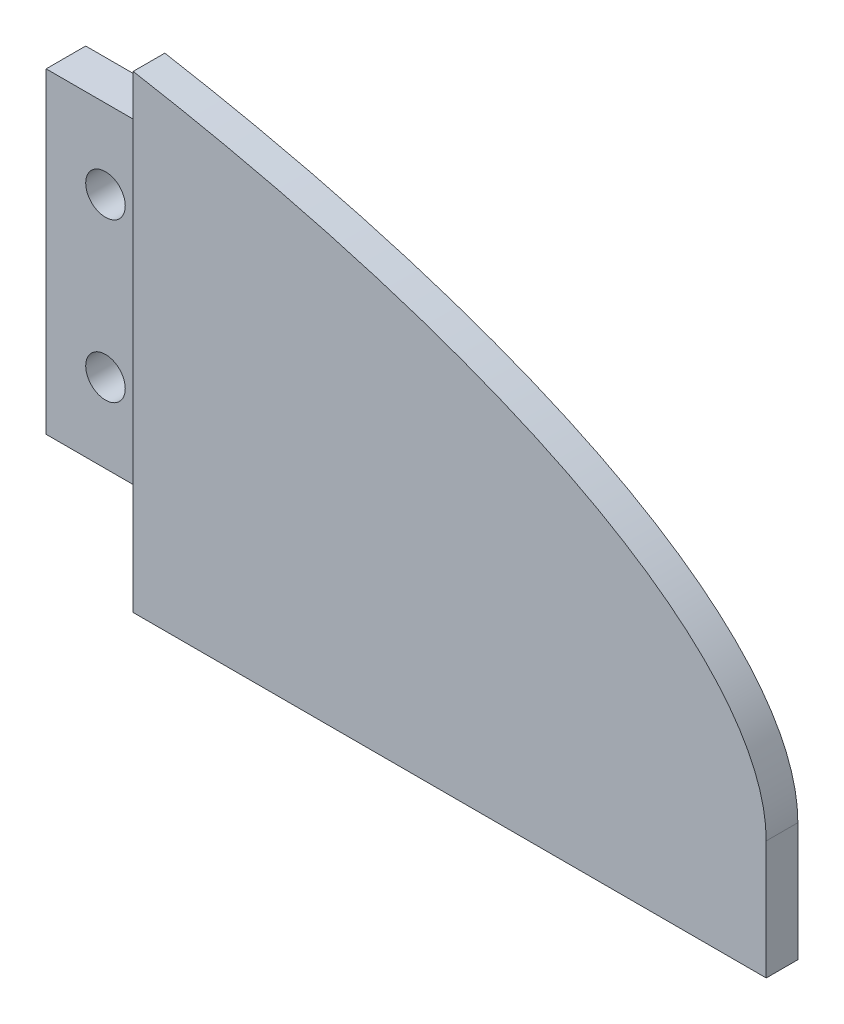
ISO-10303-21;
HEADER;
FILE_DESCRIPTION(('STEP AP214'),'2;1');
FILE_NAME('part.step','',(''),(''),'','','');
FILE_SCHEMA(('AUTOMOTIVE_DESIGN { 1 0 10303 214 1 1 1 1 }'));
ENDSEC;
DATA;
#1=APPLICATION_CONTEXT('core data for automotive mechanical design processes');
#2=APPLICATION_PROTOCOL_DEFINITION('international standard','automotive_design',2000,#1);
#3=PRODUCT_CONTEXT('',#1,'mechanical');
#4=PRODUCT('Part','Part','',(#3));
#5=PRODUCT_RELATED_PRODUCT_CATEGORY('part','',(#4));
#6=PRODUCT_DEFINITION_FORMATION('','',#4);
#7=PRODUCT_DEFINITION_CONTEXT('part definition',#1,'design');
#8=PRODUCT_DEFINITION('design','',#6,#7);
#9=PRODUCT_DEFINITION_SHAPE('','',#8);
#10=(LENGTH_UNIT() NAMED_UNIT(*) SI_UNIT(.MILLI.,.METRE.));
#11=(NAMED_UNIT(*) PLANE_ANGLE_UNIT() SI_UNIT($,.RADIAN.));
#12=(NAMED_UNIT(*) SI_UNIT($,.STERADIAN.) SOLID_ANGLE_UNIT());
#13=UNCERTAINTY_MEASURE_WITH_UNIT(LENGTH_MEASURE(1.E-05),#10,'distance_accuracy_value','');
#14=(GEOMETRIC_REPRESENTATION_CONTEXT(3) GLOBAL_UNCERTAINTY_ASSIGNED_CONTEXT((#13)) GLOBAL_UNIT_ASSIGNED_CONTEXT((#10,
#11,#12)) REPRESENTATION_CONTEXT('',''));
#15=CARTESIAN_POINT('',(0.,0.,0.));
#16=DIRECTION('',(0.,0.,1.));
#17=DIRECTION('',(1.,0.,0.));
#18=AXIS2_PLACEMENT_3D('',#15,#16,#17);
#19=CARTESIAN_POINT('',(85.,-4.99999999999998,-5.));
#20=DIRECTION('',(-1.,0.,0.));
#21=DIRECTION('',(0.,0.,1.));
#22=AXIS2_PLACEMENT_3D('',#19,#20,#21);
#23=PLANE('',#22);
#24=DIRECTION('',(0.,-1.,0.));
#25=VECTOR('',#24,1.);
#26=CARTESIAN_POINT('',(85.,-4.99999999999998,0.));
#27=LINE('',#26,#25);
#28=CARTESIAN_POINT('',(85.,35.,0.));
#29=VERTEX_POINT('',#28);
#30=CARTESIAN_POINT('',(85.,-4.99999999999998,0.));
#31=VERTEX_POINT('',#30);
#32=EDGE_CURVE('E397',#29,#31,#27,.T.);
#33=ORIENTED_EDGE('',*,*,#32,.T.);
#34=DIRECTION('',(0.,0.,1.));
#35=VECTOR('',#34,1.);
#36=CARTESIAN_POINT('',(85.,-4.99999999999998,-5.));
#37=LINE('',#36,#35);
#38=CARTESIAN_POINT('',(85.,-4.99999999999998,-5.));
#39=VERTEX_POINT('',#38);
#40=EDGE_CURVE('E42',#39,#31,#37,.T.);
#41=ORIENTED_EDGE('',*,*,#40,.F.);
#42=DIRECTION('',(0.,-1.,0.));
#43=VECTOR('',#42,1.);
#44=CARTESIAN_POINT('',(85.,-4.99999999999998,-5.));
#45=LINE('',#44,#43);
#46=CARTESIAN_POINT('',(85.,35.,-5.));
#47=VERTEX_POINT('',#46);
#48=EDGE_CURVE('E707',#47,#39,#45,.T.);
#49=ORIENTED_EDGE('',*,*,#48,.F.);
#50=DIRECTION('',(0.,0.,1.));
#51=VECTOR('',#50,1.);
#52=CARTESIAN_POINT('',(85.,35.,-5.));
#53=LINE('',#52,#51);
#54=EDGE_CURVE('E708',#47,#29,#53,.T.);
#55=ORIENTED_EDGE('',*,*,#54,.T.);
#56=EDGE_LOOP('',(#33,#41,#49,#55));
#57=FACE_BOUND('',#56,.T.);
#58=ADVANCED_FACE('F35',(#57),#23,.F.);
#59=CARTESIAN_POINT('',(85.,-4.99999999999998,-5.));
#60=DIRECTION('',(0.,1.,0.));
#61=DIRECTION('',(-1.,0.,0.));
#62=AXIS2_PLACEMENT_3D('',#59,#60,#61);
#63=PLANE('',#62);
#64=DIRECTION('',(-1.,0.,0.));
#65=VECTOR('',#64,1.);
#66=CARTESIAN_POINT('',(85.,-4.99999999999998,0.));
#67=LINE('',#66,#65);
#68=CARTESIAN_POINT('',(70.,-4.99999999999998,0.));
#69=VERTEX_POINT('',#68);
#70=EDGE_CURVE('E388',#31,#69,#67,.T.);
#71=ORIENTED_EDGE('',*,*,#70,.T.);
#72=CARTESIAN_POINT('',(55.,-4.99999999999998,0.));
#73=VERTEX_POINT('',#72);
#74=EDGE_CURVE('E389',#69,#73,#67,.T.);
#75=ORIENTED_EDGE('',*,*,#74,.T.);
#76=DIRECTION('',(0.,0.,1.));
#77=VECTOR('',#76,1.);
#78=CARTESIAN_POINT('',(55.,-4.99999999999998,-5.));
#79=LINE('',#78,#77);
#80=CARTESIAN_POINT('',(55.,-4.99999999999998,-5.));
#81=VERTEX_POINT('',#80);
#82=EDGE_CURVE('E713',#81,#73,#79,.T.);
#83=ORIENTED_EDGE('',*,*,#82,.F.);
#84=DIRECTION('',(-1.,0.,0.));
#85=VECTOR('',#84,1.);
#86=CARTESIAN_POINT('',(85.,-4.99999999999998,-5.));
#87=LINE('',#86,#85);
#88=EDGE_CURVE('E83',#39,#81,#87,.T.);
#89=ORIENTED_EDGE('',*,*,#88,.F.);
#90=ORIENTED_EDGE('',*,*,#40,.T.);
#91=EDGE_LOOP('',(#71,#75,#83,#89,#90));
#92=FACE_BOUND('',#91,.T.);
#93=ADVANCED_FACE('F380',(#92),#63,.F.);
#94=CARTESIAN_POINT('',(55.,-4.99999999999998,-5.));
#95=DIRECTION('',(1.,0.,0.));
#96=DIRECTION('',(0.,0.,-1.));
#97=AXIS2_PLACEMENT_3D('',#94,#95,#96);
#98=PLANE('',#97);
#99=DIRECTION('',(0.,1.,0.));
#100=VECTOR('',#99,1.);
#101=CARTESIAN_POINT('',(55.,-4.99999999999998,0.));
#102=LINE('',#101,#100);
#103=CARTESIAN_POINT('',(55.,35.,0.));
#104=VERTEX_POINT('',#103);
#105=EDGE_CURVE('E393',#73,#104,#102,.T.);
#106=ORIENTED_EDGE('',*,*,#105,.T.);
#107=DIRECTION('',(0.,0.,1.));
#108=VECTOR('',#107,1.);
#109=CARTESIAN_POINT('',(55.,35.,-5.));
#110=LINE('',#109,#108);
#111=CARTESIAN_POINT('',(55.,35.,-5.));
#112=VERTEX_POINT('',#111);
#113=EDGE_CURVE('E710',#112,#104,#110,.T.);
#114=ORIENTED_EDGE('',*,*,#113,.F.);
#115=DIRECTION('',(0.,1.,0.));
#116=VECTOR('',#115,1.);
#117=CARTESIAN_POINT('',(55.,-4.99999999999998,-5.));
#118=LINE('',#117,#116);
#119=EDGE_CURVE('E731',#81,#112,#118,.T.);
#120=ORIENTED_EDGE('',*,*,#119,.F.);
#121=ORIENTED_EDGE('',*,*,#82,.T.);
#122=EDGE_LOOP('',(#106,#114,#120,#121));
#123=FACE_BOUND('',#122,.T.);
#124=ADVANCED_FACE('F378',(#123),#98,.F.);
#125=CARTESIAN_POINT('',(85.,35.,-5.));
#126=DIRECTION('',(0.,-1.,0.));
#127=DIRECTION('',(0.,0.,-1.));
#128=AXIS2_PLACEMENT_3D('',#125,#126,#127);
#129=PLANE('',#128);
#130=DIRECTION('',(1.,0.,0.));
#131=VECTOR('',#130,1.);
#132=CARTESIAN_POINT('',(85.,35.,0.));
#133=LINE('',#132,#131);
#134=CARTESIAN_POINT('',(70.,35.,0.));
#135=VERTEX_POINT('',#134);
#136=EDGE_CURVE('E705',#104,#135,#133,.T.);
#137=ORIENTED_EDGE('',*,*,#136,.T.);
#138=EDGE_CURVE('E76',#135,#29,#133,.T.);
#139=ORIENTED_EDGE('',*,*,#138,.T.);
#140=ORIENTED_EDGE('',*,*,#54,.F.);
#141=DIRECTION('',(1.,0.,0.));
#142=VECTOR('',#141,1.);
#143=CARTESIAN_POINT('',(85.,35.,-5.));
#144=LINE('',#143,#142);
#145=EDGE_CURVE('E56',#112,#47,#144,.T.);
#146=ORIENTED_EDGE('',*,*,#145,.F.);
#147=ORIENTED_EDGE('',*,*,#113,.T.);
#148=EDGE_LOOP('',(#137,#139,#140,#146,#147));
#149=FACE_BOUND('',#148,.T.);
#150=ADVANCED_FACE('F372',(#149),#129,.F.);
#151=CARTESIAN_POINT('',(0.,0.,-5.));
#152=DIRECTION('',(0.,0.,1.));
#153=DIRECTION('',(1.,0.,0.));
#154=AXIS2_PLACEMENT_3D('',#151,#152,#153);
#155=PLANE('',#154);
#156=CARTESIAN_POINT('',(62.5,25.,-5.));
#157=DIRECTION('',(0.,0.,-1.));
#158=DIRECTION('',(-1.,0.,0.));
#159=AXIS2_PLACEMENT_3D('',#156,#157,#158);
#160=CIRCLE('',#159,2.5);
#161=CARTESIAN_POINT('',(60.,25.,-5.));
#162=VERTEX_POINT('',#161);
#163=EDGE_CURVE('E216',#162,#162,#160,.T.);
#164=ORIENTED_EDGE('',*,*,#163,.F.);
#165=EDGE_LOOP('',(#164));
#166=FACE_BOUND('',#165,.T.);
#167=CARTESIAN_POINT('',(62.5,5.00000000000002,-5.));
#168=DIRECTION('',(0.,0.,-1.));
#169=DIRECTION('',(-1.,0.,0.));
#170=AXIS2_PLACEMENT_3D('',#167,#168,#169);
#171=CIRCLE('',#170,2.5);
#172=CARTESIAN_POINT('',(60.,5.00000000000002,-5.));
#173=VERTEX_POINT('',#172);
#174=EDGE_CURVE('E342',#173,#173,#171,.T.);
#175=ORIENTED_EDGE('',*,*,#174,.F.);
#176=EDGE_LOOP('',(#175));
#177=FACE_BOUND('',#176,.T.);
#178=ORIENTED_EDGE('',*,*,#48,.T.);
#179=ORIENTED_EDGE('',*,*,#88,.T.);
#180=ORIENTED_EDGE('',*,*,#119,.T.);
#181=ORIENTED_EDGE('',*,*,#145,.T.);
#182=EDGE_LOOP('',(#178,#179,#180,#181));
#183=FACE_BOUND('',#182,.T.);
#184=ADVANCED_FACE('F369',(#166,#177,#183),#155,.F.);
#185=CARTESIAN_POINT('',(0.,0.,0.));
#186=DIRECTION('',(0.,0.,1.));
#187=DIRECTION('',(1.,0.,0.));
#188=AXIS2_PLACEMENT_3D('',#185,#186,#187);
#189=PLANE('',#188);
#190=DIRECTION('',(0.,-1.,0.));
#191=VECTOR('',#190,1.);
#192=CARTESIAN_POINT('',(70.,0.,0.));
#193=LINE('',#192,#191);
#194=EDGE_CURVE('E11',#135,#69,#193,.T.);
#195=ORIENTED_EDGE('',*,*,#194,.F.);
#196=ORIENTED_EDGE('',*,*,#136,.F.);
#197=ORIENTED_EDGE('',*,*,#105,.F.);
#198=ORIENTED_EDGE('',*,*,#74,.F.);
#199=EDGE_LOOP('',(#195,#196,#197,#198));
#200=FACE_BOUND('',#199,.T.);
#201=CARTESIAN_POINT('',(62.5,25.,0.));
#202=DIRECTION('',(0.,0.,1.));
#203=DIRECTION('',(1.,0.,0.));
#204=AXIS2_PLACEMENT_3D('',#201,#202,#203);
#205=CIRCLE('',#204,2.5);
#206=CARTESIAN_POINT('',(65.,25.,0.));
#207=VERTEX_POINT('',#206);
#208=EDGE_CURVE('E700',#207,#207,#205,.T.);
#209=ORIENTED_EDGE('',*,*,#208,.F.);
#210=EDGE_LOOP('',(#209));
#211=FACE_BOUND('',#210,.T.);
#212=CARTESIAN_POINT('',(62.5,5.00000000000002,0.));
#213=DIRECTION('',(0.,0.,1.));
#214=DIRECTION('',(1.,0.,0.));
#215=AXIS2_PLACEMENT_3D('',#212,#213,#214);
#216=CIRCLE('',#215,2.5);
#217=CARTESIAN_POINT('',(65.,5.00000000000002,0.));
#218=VERTEX_POINT('',#217);
#219=EDGE_CURVE('E716',#218,#218,#216,.T.);
#220=ORIENTED_EDGE('',*,*,#219,.F.);
#221=EDGE_LOOP('',(#220));
#222=FACE_BOUND('',#221,.T.);
#223=ADVANCED_FACE('F367',(#200,#211,#222),#189,.T.);
#224=CARTESIAN_POINT('',(62.5,5.00000000000002,11.0710678118655));
#225=DIRECTION('',(0.,0.,-1.));
#226=DIRECTION('',(-1.,0.,0.));
#227=AXIS2_PLACEMENT_3D('',#224,#225,#226);
#228=CYLINDRICAL_SURFACE('',#227,2.5);
#229=ORIENTED_EDGE('',*,*,#219,.T.);
#230=EDGE_LOOP('',(#229));
#231=FACE_BOUND('',#230,.T.);
#232=ORIENTED_EDGE('',*,*,#174,.T.);
#233=EDGE_LOOP('',(#232));
#234=FACE_BOUND('',#233,.T.);
#235=ADVANCED_FACE('F363',(#231,#234),#228,.F.);
#236=CARTESIAN_POINT('',(62.5,25.,11.0710678118655));
#237=DIRECTION('',(0.,0.,-1.));
#238=DIRECTION('',(-1.,0.,0.));
#239=AXIS2_PLACEMENT_3D('',#236,#237,#238);
#240=CYLINDRICAL_SURFACE('',#239,2.5);
#241=ORIENTED_EDGE('',*,*,#208,.T.);
#242=EDGE_LOOP('',(#241));
#243=FACE_BOUND('',#242,.T.);
#244=ORIENTED_EDGE('',*,*,#163,.T.);
#245=EDGE_LOOP('',(#244));
#246=FACE_BOUND('',#245,.T.);
#247=ADVANCED_FACE('F352',(#243,#246),#240,.F.);
#248=CARTESIAN_POINT('',(0.,0.,0.));
#249=DIRECTION('',(0.,0.,1.));
#250=DIRECTION('',(1.,0.,0.));
#251=AXIS2_PLACEMENT_3D('',#248,#249,#250);
#252=PLANE('',#251);
#253=DIRECTION('',(0.,-1.,0.));
#254=VECTOR('',#253,1.);
#255=CARTESIAN_POINT('',(70.,0.,0.));
#256=LINE('',#255,#254);
#257=CARTESIAN_POINT('',(70.,-15.,0.));
#258=VERTEX_POINT('',#257);
#259=EDGE_CURVE('E202',#69,#258,#256,.T.);
#260=ORIENTED_EDGE('',*,*,#259,.F.);
#261=ORIENTED_EDGE('',*,*,#70,.F.);
#262=ORIENTED_EDGE('',*,*,#32,.F.);
#263=ORIENTED_EDGE('',*,*,#138,.F.);
#264=CARTESIAN_POINT('',(70.,44.2216638714053,0.));
#265=VERTEX_POINT('',#264);
#266=EDGE_CURVE('E196',#265,#135,#256,.T.);
#267=ORIENTED_EDGE('',*,*,#266,.F.);
#268=CARTESIAN_POINT('',(0.,0.,0.));
#269=DIRECTION('',(0.,0.,1.));
#270=DIRECTION('',(1.,0.,0.));
#271=AXIS2_PLACEMENT_3D('',#268,#269,#270);
#272=ELLIPSE('',#271,150.,50.);
#273=CARTESIAN_POINT('',(150.,0.,0.));
#274=VERTEX_POINT('',#273);
#275=EDGE_CURVE('E182',#274,#265,#272,.T.);
#276=ORIENTED_EDGE('',*,*,#275,.F.);
#277=DIRECTION('',(0.,1.,0.));
#278=VECTOR('',#277,1.);
#279=CARTESIAN_POINT('',(150.,-15.,0.));
#280=LINE('',#279,#278);
#281=CARTESIAN_POINT('',(150.,-15.,0.));
#282=VERTEX_POINT('',#281);
#283=EDGE_CURVE('E287',#282,#274,#280,.T.);
#284=ORIENTED_EDGE('',*,*,#283,.F.);
#285=DIRECTION('',(1.,0.,0.));
#286=VECTOR('',#285,1.);
#287=CARTESIAN_POINT('',(-150.,-15.,0.));
#288=LINE('',#287,#286);
#289=CARTESIAN_POINT('',(138.,-15.,0.));
#290=VERTEX_POINT('',#289);
#291=EDGE_CURVE('E220',#290,#282,#288,.T.);
#292=ORIENTED_EDGE('',*,*,#291,.F.);
#293=DIRECTION('',(0.,1.,0.));
#294=VECTOR('',#293,1.);
#295=CARTESIAN_POINT('',(138.,-2.51983106480912,0.));
#296=LINE('',#295,#294);
#297=CARTESIAN_POINT('',(138.,-2.51983106480913,0.));
#298=VERTEX_POINT('',#297);
#299=EDGE_CURVE('E261',#290,#298,#296,.T.);
#300=ORIENTED_EDGE('',*,*,#299,.T.);
#301=DIRECTION('',(1.,0.,0.));
#302=VECTOR('',#301,1.);
#303=CARTESIAN_POINT('',(135.,-2.51983106480913,0.));
#304=LINE('',#303,#302);
#305=CARTESIAN_POINT('',(113.,-2.51983106480913,0.));
#306=VERTEX_POINT('',#305);
#307=EDGE_CURVE('E301',#306,#298,#304,.T.);
#308=ORIENTED_EDGE('',*,*,#307,.F.);
#309=CARTESIAN_POINT('',(87.,-2.51983106480913,0.));
#310=VERTEX_POINT('',#309);
#311=EDGE_CURVE('E299',#310,#306,#304,.T.);
#312=ORIENTED_EDGE('',*,*,#311,.F.);
#313=DIRECTION('',(0.,-1.,0.));
#314=VECTOR('',#313,1.);
#315=CARTESIAN_POINT('',(87.,-15.,0.));
#316=LINE('',#315,#314);
#317=CARTESIAN_POINT('',(87.,-15.,0.));
#318=VERTEX_POINT('',#317);
#319=EDGE_CURVE('E238',#310,#318,#316,.T.);
#320=ORIENTED_EDGE('',*,*,#319,.T.);
#321=EDGE_CURVE('E224',#258,#318,#288,.T.);
#322=ORIENTED_EDGE('',*,*,#321,.F.);
#323=EDGE_LOOP('',(#260,#261,#262,#263,#267,#276,#284,#292,#300,#308,#312,#320,#322));
#324=FACE_BOUND('',#323,.T.);
#325=ADVANCED_FACE('F198',(#324),#252,.F.);
#326=CARTESIAN_POINT('',(70.,0.,0.));
#327=DIRECTION('',(-1.,0.,0.));
#328=DIRECTION('',(0.,-1.,0.));
#329=AXIS2_PLACEMENT_3D('',#326,#327,#328);
#330=PLANE('',#329);
#331=DIRECTION('',(0.,0.,-1.));
#332=VECTOR('',#331,1.);
#333=CARTESIAN_POINT('',(70.,44.2216638714053,4.));
#334=LINE('',#333,#332);
#335=CARTESIAN_POINT('',(70.,44.2216638714053,4.));
#336=VERTEX_POINT('',#335);
#337=EDGE_CURVE('E186',#336,#265,#334,.T.);
#338=ORIENTED_EDGE('',*,*,#337,.T.);
#339=ORIENTED_EDGE('',*,*,#266,.T.);
#340=ORIENTED_EDGE('',*,*,#194,.T.);
#341=ORIENTED_EDGE('',*,*,#259,.T.);
#342=DIRECTION('',(0.,0.,-1.));
#343=VECTOR('',#342,1.);
#344=CARTESIAN_POINT('',(70.,-15.,0.));
#345=LINE('',#344,#343);
#346=CARTESIAN_POINT('',(70.,-15.,4.));
#347=VERTEX_POINT('',#346);
#348=EDGE_CURVE('E210',#347,#258,#345,.T.);
#349=ORIENTED_EDGE('',*,*,#348,.F.);
#350=DIRECTION('',(0.,-1.,0.));
#351=VECTOR('',#350,1.);
#352=CARTESIAN_POINT('',(70.,0.,4.));
#353=LINE('',#352,#351);
#354=EDGE_CURVE('E201',#336,#347,#353,.T.);
#355=ORIENTED_EDGE('',*,*,#354,.F.);
#356=EDGE_LOOP('',(#338,#339,#340,#341,#349,#355));
#357=FACE_BOUND('',#356,.T.);
#358=ADVANCED_FACE('F204',(#357),#330,.T.);
#359=CARTESIAN_POINT('',(0.,0.,4.));
#360=DIRECTION('',(0.,0.,1.));
#361=DIRECTION('',(1.,0.,0.));
#362=AXIS2_PLACEMENT_3D('',#359,#360,#361);
#363=ELLIPSE('',#362,150.,50.);
#364=DIRECTION('',(0.,0.,-1.));
#365=VECTOR('',#364,1.);
#366=SURFACE_OF_LINEAR_EXTRUSION('',#363,#365);
#367=ORIENTED_EDGE('',*,*,#337,.F.);
#368=CARTESIAN_POINT('',(150.,0.,4.));
#369=VERTEX_POINT('',#368);
#370=EDGE_CURVE('E193',#369,#336,#363,.T.);
#371=ORIENTED_EDGE('',*,*,#370,.F.);
#372=DIRECTION('',(0.,0.,-1.));
#373=VECTOR('',#372,1.);
#374=CARTESIAN_POINT('',(150.,0.,4.));
#375=LINE('',#374,#373);
#376=EDGE_CURVE('E189',#369,#274,#375,.T.);
#377=ORIENTED_EDGE('',*,*,#376,.T.);
#378=ORIENTED_EDGE('',*,*,#275,.T.);
#379=EDGE_LOOP('',(#367,#371,#377,#378));
#380=FACE_BOUND('',#379,.T.);
#381=ADVANCED_FACE('F184',(#380),#366,.F.);
#382=CARTESIAN_POINT('',(0.,0.,4.));
#383=DIRECTION('',(0.,0.,1.));
#384=DIRECTION('',(1.,0.,0.));
#385=AXIS2_PLACEMENT_3D('',#382,#383,#384);
#386=PLANE('',#385);
#387=ORIENTED_EDGE('',*,*,#370,.T.);
#388=ORIENTED_EDGE('',*,*,#354,.T.);
#389=DIRECTION('',(-1.,0.,0.));
#390=VECTOR('',#389,1.);
#391=CARTESIAN_POINT('',(-150.,-15.,4.));
#392=LINE('',#391,#390);
#393=CARTESIAN_POINT('',(150.,-15.,4.));
#394=VERTEX_POINT('',#393);
#395=EDGE_CURVE('E292',#394,#347,#392,.T.);
#396=ORIENTED_EDGE('',*,*,#395,.F.);
#397=DIRECTION('',(0.,1.,0.));
#398=VECTOR('',#397,1.);
#399=CARTESIAN_POINT('',(150.,-15.,4.));
#400=LINE('',#399,#398);
#401=EDGE_CURVE('E289',#394,#369,#400,.T.);
#402=ORIENTED_EDGE('',*,*,#401,.T.);
#403=EDGE_LOOP('',(#387,#388,#396,#402));
#404=FACE_BOUND('',#403,.T.);
#405=ADVANCED_FACE('F348',(#404),#386,.T.);
#406=CARTESIAN_POINT('',(0.,-15.,0.));
#407=DIRECTION('',(0.,-1.,0.));
#408=DIRECTION('',(0.,0.,-1.));
#409=AXIS2_PLACEMENT_3D('',#406,#407,#408);
#410=PLANE('',#409);
#411=CARTESIAN_POINT('',(125.,-15.,-5.));
#412=DIRECTION('',(0.,-1.,0.));
#413=DIRECTION('',(0.,0.,-1.));
#414=AXIS2_PLACEMENT_3D('',#411,#412,#413);
#415=CIRCLE('',#414,2.5);
#416=CARTESIAN_POINT('',(125.,-15.,-7.5));
#417=VERTEX_POINT('',#416);
#418=EDGE_CURVE('E310',#417,#417,#415,.F.);
#419=ORIENTED_EDGE('',*,*,#418,.T.);
#420=EDGE_LOOP('',(#419));
#421=FACE_BOUND('',#420,.T.);
#422=CARTESIAN_POINT('',(100.,-15.,-5.));
#423=DIRECTION('',(0.,-1.,0.));
#424=DIRECTION('',(0.,0.,-1.));
#425=AXIS2_PLACEMENT_3D('',#422,#423,#424);
#426=CIRCLE('',#425,2.5);
#427=CARTESIAN_POINT('',(100.,-15.,-7.5));
#428=VERTEX_POINT('',#427);
#429=EDGE_CURVE('E337',#428,#428,#426,.F.);
#430=ORIENTED_EDGE('',*,*,#429,.T.);
#431=EDGE_LOOP('',(#430));
#432=FACE_BOUND('',#431,.T.);
#433=ORIENTED_EDGE('',*,*,#395,.T.);
#434=ORIENTED_EDGE('',*,*,#348,.T.);
#435=ORIENTED_EDGE('',*,*,#321,.T.);
#436=DIRECTION('',(-0.707106781186544,0.,0.707106781186551));
#437=VECTOR('',#436,1.);
#438=CARTESIAN_POINT('',(90.,-15.,-3.00000000000003));
#439=LINE('',#438,#437);
#440=CARTESIAN_POINT('',(90.,-15.,-3.00000000000003));
#441=VERTEX_POINT('',#440);
#442=EDGE_CURVE('E213',#318,#441,#439,.F.);
#443=ORIENTED_EDGE('',*,*,#442,.T.);
#444=DIRECTION('',(0.,0.,1.));
#445=VECTOR('',#444,1.);
#446=CARTESIAN_POINT('',(90.,-15.,-10.));
#447=LINE('',#446,#445);
#448=CARTESIAN_POINT('',(90.,-15.,-10.));
#449=VERTEX_POINT('',#448);
#450=EDGE_CURVE('E319',#449,#441,#447,.T.);
#451=ORIENTED_EDGE('',*,*,#450,.F.);
#452=DIRECTION('',(-1.,0.,0.));
#453=VECTOR('',#452,1.);
#454=CARTESIAN_POINT('',(110.,-15.,-10.));
#455=LINE('',#454,#453);
#456=CARTESIAN_POINT('',(110.,-15.,-10.));
#457=VERTEX_POINT('',#456);
#458=EDGE_CURVE('E332',#457,#449,#455,.T.);
#459=ORIENTED_EDGE('',*,*,#458,.F.);
#460=DIRECTION('',(0.,0.,1.));
#461=VECTOR('',#460,1.);
#462=CARTESIAN_POINT('',(110.,-15.,-10.));
#463=LINE('',#462,#461);
#464=CARTESIAN_POINT('',(110.,-15.,-3.00000000000005));
#465=VERTEX_POINT('',#464);
#466=EDGE_CURVE('E316',#457,#465,#463,.T.);
#467=ORIENTED_EDGE('',*,*,#466,.T.);
#468=DIRECTION('',(-0.707106781186544,0.,-0.707106781186551));
#469=VECTOR('',#468,1.);
#470=CARTESIAN_POINT('',(110.,-15.,-3.00000000000005));
#471=LINE('',#470,#469);
#472=CARTESIAN_POINT('',(112.5,-15.,-0.500000000000029));
#473=VERTEX_POINT('',#472);
#474=EDGE_CURVE('E233',#465,#473,#471,.F.);
#475=ORIENTED_EDGE('',*,*,#474,.T.);
#476=DIRECTION('',(-0.707106781186541,0.,0.707106781186554));
#477=VECTOR('',#476,1.);
#478=CARTESIAN_POINT('',(115.,-15.,-3.00000000000006));
#479=LINE('',#478,#477);
#480=CARTESIAN_POINT('',(115.,-15.,-3.00000000000006));
#481=VERTEX_POINT('',#480);
#482=EDGE_CURVE('E250',#473,#481,#479,.F.);
#483=ORIENTED_EDGE('',*,*,#482,.T.);
#484=DIRECTION('',(0.,0.,1.));
#485=VECTOR('',#484,1.);
#486=CARTESIAN_POINT('',(115.,-15.,-10.));
#487=LINE('',#486,#485);
#488=CARTESIAN_POINT('',(115.,-15.,-10.));
#489=VERTEX_POINT('',#488);
#490=EDGE_CURVE('E280',#489,#481,#487,.T.);
#491=ORIENTED_EDGE('',*,*,#490,.F.);
#492=DIRECTION('',(-1.,0.,0.));
#493=VECTOR('',#492,1.);
#494=CARTESIAN_POINT('',(135.,-15.,-10.));
#495=LINE('',#494,#493);
#496=CARTESIAN_POINT('',(135.,-15.,-10.));
#497=VERTEX_POINT('',#496);
#498=EDGE_CURVE('E306',#497,#489,#495,.T.);
#499=ORIENTED_EDGE('',*,*,#498,.F.);
#500=DIRECTION('',(0.,0.,1.));
#501=VECTOR('',#500,1.);
#502=CARTESIAN_POINT('',(135.,-15.,-10.));
#503=LINE('',#502,#501);
#504=CARTESIAN_POINT('',(135.,-15.,-3.00000000000006));
#505=VERTEX_POINT('',#504);
#506=EDGE_CURVE('E278',#497,#505,#503,.T.);
#507=ORIENTED_EDGE('',*,*,#506,.T.);
#508=DIRECTION('',(-0.707106781186545,0.,-0.70710678118655));
#509=VECTOR('',#508,1.);
#510=CARTESIAN_POINT('',(135.,-15.,-3.00000000000006));
#511=LINE('',#510,#509);
#512=EDGE_CURVE('E257',#505,#290,#511,.F.);
#513=ORIENTED_EDGE('',*,*,#512,.T.);
#514=ORIENTED_EDGE('',*,*,#291,.T.);
#515=DIRECTION('',(0.,0.,1.));
#516=VECTOR('',#515,1.);
#517=CARTESIAN_POINT('',(150.,-15.,4.));
#518=LINE('',#517,#516);
#519=EDGE_CURVE('E226',#282,#394,#518,.T.);
#520=ORIENTED_EDGE('',*,*,#519,.T.);
#521=EDGE_LOOP('',(#433,#434,#435,#443,#451,#459,#467,#475,#483,#491,#499,#507,#513,#514,#520));
#522=FACE_BOUND('',#521,.T.);
#523=ADVANCED_FACE('F355',(#421,#432,#522),#410,.T.);
#524=CARTESIAN_POINT('',(150.,-15.,4.));
#525=DIRECTION('',(-1.,0.,0.));
#526=DIRECTION('',(0.,0.,1.));
#527=AXIS2_PLACEMENT_3D('',#524,#525,#526);
#528=PLANE('',#527);
#529=ORIENTED_EDGE('',*,*,#376,.F.);
#530=ORIENTED_EDGE('',*,*,#401,.F.);
#531=ORIENTED_EDGE('',*,*,#519,.F.);
#532=ORIENTED_EDGE('',*,*,#283,.T.);
#533=EDGE_LOOP('',(#529,#530,#531,#532));
#534=FACE_BOUND('',#533,.T.);
#535=ADVANCED_FACE('F359',(#534),#528,.F.);
#536=CARTESIAN_POINT('',(135.,-15.,-10.));
#537=DIRECTION('',(-1.,0.,0.));
#538=DIRECTION('',(0.,-1.,0.));
#539=AXIS2_PLACEMENT_3D('',#536,#537,#538);
#540=PLANE('',#539);
#541=DIRECTION('',(0.,0.,1.));
#542=VECTOR('',#541,1.);
#543=CARTESIAN_POINT('',(135.,-2.51983106480913,-10.));
#544=LINE('',#543,#542);
#545=CARTESIAN_POINT('',(135.,-2.51983106480913,-10.));
#546=VERTEX_POINT('',#545);
#547=CARTESIAN_POINT('',(135.,-2.51983106480913,-3.00000000000006));
#548=VERTEX_POINT('',#547);
#549=EDGE_CURVE('E296',#546,#548,#544,.T.);
#550=ORIENTED_EDGE('',*,*,#549,.T.);
#551=DIRECTION('',(0.,-1.,0.));
#552=VECTOR('',#551,1.);
#553=CARTESIAN_POINT('',(135.,-15.,-3.00000000000006));
#554=LINE('',#553,#552);
#555=EDGE_CURVE('E263',#548,#505,#554,.T.);
#556=ORIENTED_EDGE('',*,*,#555,.T.);
#557=ORIENTED_EDGE('',*,*,#506,.F.);
#558=DIRECTION('',(0.,-1.,0.));
#559=VECTOR('',#558,1.);
#560=CARTESIAN_POINT('',(135.,-15.,-10.));
#561=LINE('',#560,#559);
#562=EDGE_CURVE('E302',#546,#497,#561,.T.);
#563=ORIENTED_EDGE('',*,*,#562,.F.);
#564=EDGE_LOOP('',(#550,#556,#557,#563));
#565=FACE_BOUND('',#564,.T.);
#566=ADVANCED_FACE('F412',(#565),#540,.F.);
#567=CARTESIAN_POINT('',(115.,-15.,-10.));
#568=DIRECTION('',(1.,0.,0.));
#569=DIRECTION('',(0.,0.,-1.));
#570=AXIS2_PLACEMENT_3D('',#567,#568,#569);
#571=PLANE('',#570);
#572=ORIENTED_EDGE('',*,*,#490,.T.);
#573=DIRECTION('',(0.,1.,0.));
#574=VECTOR('',#573,1.);
#575=CARTESIAN_POINT('',(115.,-2.51983106480913,-3.00000000000006));
#576=LINE('',#575,#574);
#577=CARTESIAN_POINT('',(115.,-2.51983106480913,-3.00000000000006));
#578=VERTEX_POINT('',#577);
#579=EDGE_CURVE('E259',#481,#578,#576,.T.);
#580=ORIENTED_EDGE('',*,*,#579,.T.);
#581=DIRECTION('',(0.,0.,1.));
#582=VECTOR('',#581,1.);
#583=CARTESIAN_POINT('',(115.,-2.51983106480913,-10.));
#584=LINE('',#583,#582);
#585=CARTESIAN_POINT('',(115.,-2.51983106480913,-10.));
#586=VERTEX_POINT('',#585);
#587=EDGE_CURVE('E285',#586,#578,#584,.T.);
#588=ORIENTED_EDGE('',*,*,#587,.F.);
#589=DIRECTION('',(0.,1.,0.));
#590=VECTOR('',#589,1.);
#591=CARTESIAN_POINT('',(115.,-15.,-10.));
#592=LINE('',#591,#590);
#593=EDGE_CURVE('E304',#489,#586,#592,.T.);
#594=ORIENTED_EDGE('',*,*,#593,.F.);
#595=EDGE_LOOP('',(#572,#580,#588,#594));
#596=FACE_BOUND('',#595,.T.);
#597=ADVANCED_FACE('F419',(#596),#571,.F.);
#598=CARTESIAN_POINT('',(135.,-2.51983106480913,-10.));
#599=DIRECTION('',(0.,-1.,0.));
#600=DIRECTION('',(0.,0.,-1.));
#601=AXIS2_PLACEMENT_3D('',#598,#599,#600);
#602=PLANE('',#601);
#603=CARTESIAN_POINT('',(125.,-2.51983106480913,-5.));
#604=DIRECTION('',(0.,1.,0.));
#605=DIRECTION('',(0.,0.,1.));
#606=AXIS2_PLACEMENT_3D('',#603,#604,#605);
#607=CIRCLE('',#606,2.5);
#608=CARTESIAN_POINT('',(125.,-2.51983106480913,-2.50000000000001));
#609=VERTEX_POINT('',#608);
#610=EDGE_CURVE('E313',#609,#609,#607,.T.);
#611=ORIENTED_EDGE('',*,*,#610,.F.);
#612=EDGE_LOOP('',(#611));
#613=FACE_BOUND('',#612,.T.);
#614=DIRECTION('',(0.707106781186541,0.,-0.707106781186554));
#615=VECTOR('',#614,1.);
#616=CARTESIAN_POINT('',(128.5,-2.51983106480913,-16.5000000000001));
#617=LINE('',#616,#615);
#618=CARTESIAN_POINT('',(112.5,-2.51983106480913,-0.500000000000025));
#619=VERTEX_POINT('',#618);
#620=EDGE_CURVE('E252',#578,#619,#617,.F.);
#621=ORIENTED_EDGE('',*,*,#620,.T.);
#622=DIRECTION('',(-0.707106781186544,0.,-0.707106781186551));
#623=VECTOR('',#622,1.);
#624=CARTESIAN_POINT('',(110.,-2.51983106480913,-3.00000000000004));
#625=LINE('',#624,#623);
#626=EDGE_CURVE('E241',#619,#306,#625,.F.);
#627=ORIENTED_EDGE('',*,*,#626,.T.);
#628=ORIENTED_EDGE('',*,*,#307,.T.);
#629=DIRECTION('',(0.707106781186545,0.,0.70710678118655));
#630=VECTOR('',#629,1.);
#631=CARTESIAN_POINT('',(131.5,-2.51983106480913,-6.50000000000005));
#632=LINE('',#631,#630);
#633=EDGE_CURVE('E255',#298,#548,#632,.F.);
#634=ORIENTED_EDGE('',*,*,#633,.T.);
#635=ORIENTED_EDGE('',*,*,#549,.F.);
#636=DIRECTION('',(1.,0.,0.));
#637=VECTOR('',#636,1.);
#638=CARTESIAN_POINT('',(135.,-2.51983106480913,-10.));
#639=LINE('',#638,#637);
#640=EDGE_CURVE('E298',#586,#546,#639,.T.);
#641=ORIENTED_EDGE('',*,*,#640,.F.);
#642=ORIENTED_EDGE('',*,*,#587,.T.);
#643=EDGE_LOOP('',(#621,#627,#628,#634,#635,#641,#642));
#644=FACE_BOUND('',#643,.T.);
#645=ADVANCED_FACE('F409',(#613,#644),#602,.F.);
#646=CARTESIAN_POINT('',(0.,0.,-10.));
#647=DIRECTION('',(0.,0.,1.));
#648=DIRECTION('',(1.,0.,0.));
#649=AXIS2_PLACEMENT_3D('',#646,#647,#648);
#650=PLANE('',#649);
#651=ORIENTED_EDGE('',*,*,#562,.T.);
#652=ORIENTED_EDGE('',*,*,#498,.T.);
#653=ORIENTED_EDGE('',*,*,#593,.T.);
#654=ORIENTED_EDGE('',*,*,#640,.T.);
#655=EDGE_LOOP('',(#651,#652,#653,#654));
#656=FACE_BOUND('',#655,.T.);
#657=ADVANCED_FACE('F414',(#656),#650,.F.);
#658=CARTESIAN_POINT('',(125.,-22.0710678118655,-5.));
#659=DIRECTION('',(0.,1.,0.));
#660=DIRECTION('',(0.,0.,1.));
#661=AXIS2_PLACEMENT_3D('',#658,#659,#660);
#662=CYLINDRICAL_SURFACE('',#661,2.5);
#663=ORIENTED_EDGE('',*,*,#610,.T.);
#664=EDGE_LOOP('',(#663));
#665=FACE_BOUND('',#664,.T.);
#666=ORIENTED_EDGE('',*,*,#418,.F.);
#667=EDGE_LOOP('',(#666));
#668=FACE_BOUND('',#667,.T.);
#669=ADVANCED_FACE('F458',(#665,#668),#662,.F.);
#670=CARTESIAN_POINT('',(135.,-15.,-3.00000000000006));
#671=DIRECTION('',(0.70710678118655,0.,-0.707106781186545));
#672=DIRECTION('',(0.,1.,0.));
#673=AXIS2_PLACEMENT_3D('',#670,#671,#672);
#674=PLANE('',#673);
#675=ORIENTED_EDGE('',*,*,#633,.F.);
#676=ORIENTED_EDGE('',*,*,#299,.F.);
#677=ORIENTED_EDGE('',*,*,#512,.F.);
#678=ORIENTED_EDGE('',*,*,#555,.F.);
#679=EDGE_LOOP('',(#675,#676,#677,#678));
#680=FACE_BOUND('',#679,.T.);
#681=ADVANCED_FACE('F406',(#680),#674,.T.);
#682=CARTESIAN_POINT('',(115.,-15.,-3.00000000000006));
#683=DIRECTION('',(-0.707106781186554,0.,-0.707106781186541));
#684=DIRECTION('',(0.,-1.,0.));
#685=AXIS2_PLACEMENT_3D('',#682,#683,#684);
#686=PLANE('',#685);
#687=ORIENTED_EDGE('',*,*,#482,.F.);
#688=DIRECTION('',(0.,1.,0.));
#689=VECTOR('',#688,1.);
#690=CARTESIAN_POINT('',(112.5,-15.,-0.500000000000038));
#691=LINE('',#690,#689);
#692=EDGE_CURVE('E244',#473,#619,#691,.T.);
#693=ORIENTED_EDGE('',*,*,#692,.T.);
#694=ORIENTED_EDGE('',*,*,#620,.F.);
#695=ORIENTED_EDGE('',*,*,#579,.F.);
#696=EDGE_LOOP('',(#687,#693,#694,#695));
#697=FACE_BOUND('',#696,.T.);
#698=ADVANCED_FACE('F423',(#697),#686,.T.);
#699=CARTESIAN_POINT('',(110.,-15.,-10.));
#700=DIRECTION('',(-1.,0.,0.));
#701=DIRECTION('',(0.,-1.,0.));
#702=AXIS2_PLACEMENT_3D('',#699,#700,#701);
#703=PLANE('',#702);
#704=DIRECTION('',(0.,0.,1.));
#705=VECTOR('',#704,1.);
#706=CARTESIAN_POINT('',(110.,-2.51983106480913,-10.));
#707=LINE('',#706,#705);
#708=CARTESIAN_POINT('',(110.,-2.51983106480913,-10.));
#709=VERTEX_POINT('',#708);
#710=CARTESIAN_POINT('',(110.,-2.51983106480913,-3.00000000000005));
#711=VERTEX_POINT('',#710);
#712=EDGE_CURVE('E325',#709,#711,#707,.T.);
#713=ORIENTED_EDGE('',*,*,#712,.T.);
#714=DIRECTION('',(0.,-1.,0.));
#715=VECTOR('',#714,1.);
#716=CARTESIAN_POINT('',(110.,-15.,-3.00000000000005));
#717=LINE('',#716,#715);
#718=EDGE_CURVE('E247',#711,#465,#717,.T.);
#719=ORIENTED_EDGE('',*,*,#718,.T.);
#720=ORIENTED_EDGE('',*,*,#466,.F.);
#721=DIRECTION('',(0.,-1.,0.));
#722=VECTOR('',#721,1.);
#723=CARTESIAN_POINT('',(110.,-15.,-10.));
#724=LINE('',#723,#722);
#725=EDGE_CURVE('E334',#709,#457,#724,.T.);
#726=ORIENTED_EDGE('',*,*,#725,.F.);
#727=EDGE_LOOP('',(#713,#719,#720,#726));
#728=FACE_BOUND('',#727,.T.);
#729=ADVANCED_FACE('F448',(#728),#703,.F.);
#730=CARTESIAN_POINT('',(90.,-15.,-10.));
#731=DIRECTION('',(1.,0.,0.));
#732=DIRECTION('',(0.,0.,-1.));
#733=AXIS2_PLACEMENT_3D('',#730,#731,#732);
#734=PLANE('',#733);
#735=ORIENTED_EDGE('',*,*,#450,.T.);
#736=DIRECTION('',(0.,1.,0.));
#737=VECTOR('',#736,1.);
#738=CARTESIAN_POINT('',(90.,-2.51983106480913,-3.00000000000003));
#739=LINE('',#738,#737);
#740=CARTESIAN_POINT('',(90.,-2.51983106480913,-3.00000000000003));
#741=VERTEX_POINT('',#740);
#742=EDGE_CURVE('E235',#441,#741,#739,.T.);
#743=ORIENTED_EDGE('',*,*,#742,.T.);
#744=DIRECTION('',(0.,0.,1.));
#745=VECTOR('',#744,1.);
#746=CARTESIAN_POINT('',(90.,-2.51983106480913,-10.));
#747=LINE('',#746,#745);
#748=CARTESIAN_POINT('',(90.,-2.51983106480913,-10.));
#749=VERTEX_POINT('',#748);
#750=EDGE_CURVE('E322',#749,#741,#747,.T.);
#751=ORIENTED_EDGE('',*,*,#750,.F.);
#752=DIRECTION('',(0.,1.,0.));
#753=VECTOR('',#752,1.);
#754=CARTESIAN_POINT('',(90.,-15.,-10.));
#755=LINE('',#754,#753);
#756=EDGE_CURVE('E330',#449,#749,#755,.T.);
#757=ORIENTED_EDGE('',*,*,#756,.F.);
#758=EDGE_LOOP('',(#735,#743,#751,#757));
#759=FACE_BOUND('',#758,.T.);
#760=ADVANCED_FACE('F442',(#759),#734,.F.);
#761=CARTESIAN_POINT('',(110.,-2.51983106480913,-10.));
#762=DIRECTION('',(0.,-1.,0.));
#763=DIRECTION('',(0.,0.,-1.));
#764=AXIS2_PLACEMENT_3D('',#761,#762,#763);
#765=PLANE('',#764);
#766=CARTESIAN_POINT('',(100.,-2.51983106480913,-5.));
#767=DIRECTION('',(0.,1.,0.));
#768=DIRECTION('',(0.,0.,1.));
#769=AXIS2_PLACEMENT_3D('',#766,#767,#768);
#770=CIRCLE('',#769,2.5);
#771=CARTESIAN_POINT('',(100.,-2.51983106480913,-2.50000000000001));
#772=VERTEX_POINT('',#771);
#773=EDGE_CURVE('E340',#772,#772,#770,.T.);
#774=ORIENTED_EDGE('',*,*,#773,.F.);
#775=EDGE_LOOP('',(#774));
#776=FACE_BOUND('',#775,.T.);
#777=DIRECTION('',(0.707106781186544,0.,-0.707106781186551));
#778=VECTOR('',#777,1.);
#779=CARTESIAN_POINT('',(103.5,-2.51983106480913,-16.5000000000001));
#780=LINE('',#779,#778);
#781=EDGE_CURVE('E228',#741,#310,#780,.F.);
#782=ORIENTED_EDGE('',*,*,#781,.T.);
#783=ORIENTED_EDGE('',*,*,#311,.T.);
#784=ORIENTED_EDGE('',*,*,#626,.F.);
#785=DIRECTION('',(0.707106781186544,0.,0.707106781186551));
#786=VECTOR('',#785,1.);
#787=CARTESIAN_POINT('',(106.5,-2.51983106480913,-6.50000000000006));
#788=LINE('',#787,#786);
#789=EDGE_CURVE('E231',#619,#711,#788,.F.);
#790=ORIENTED_EDGE('',*,*,#789,.T.);
#791=ORIENTED_EDGE('',*,*,#712,.F.);
#792=DIRECTION('',(1.,0.,0.));
#793=VECTOR('',#792,1.);
#794=CARTESIAN_POINT('',(110.,-2.51983106480913,-10.));
#795=LINE('',#794,#793);
#796=EDGE_CURVE('E328',#749,#709,#795,.T.);
#797=ORIENTED_EDGE('',*,*,#796,.F.);
#798=ORIENTED_EDGE('',*,*,#750,.T.);
#799=EDGE_LOOP('',(#782,#783,#784,#790,#791,#797,#798));
#800=FACE_BOUND('',#799,.T.);
#801=ADVANCED_FACE('F431',(#776,#800),#765,.F.);
#802=CARTESIAN_POINT('',(-25.,0.,-10.));
#803=DIRECTION('',(0.,0.,1.));
#804=DIRECTION('',(1.,0.,0.));
#805=AXIS2_PLACEMENT_3D('',#802,#803,#804);
#806=PLANE('',#805);
#807=ORIENTED_EDGE('',*,*,#725,.T.);
#808=ORIENTED_EDGE('',*,*,#458,.T.);
#809=ORIENTED_EDGE('',*,*,#756,.T.);
#810=ORIENTED_EDGE('',*,*,#796,.T.);
#811=EDGE_LOOP('',(#807,#808,#809,#810));
#812=FACE_BOUND('',#811,.T.);
#813=ADVANCED_FACE('F444',(#812),#806,.F.);
#814=CARTESIAN_POINT('',(100.,-22.0710678118655,-5.));
#815=DIRECTION('',(0.,1.,0.));
#816=DIRECTION('',(0.,0.,1.));
#817=AXIS2_PLACEMENT_3D('',#814,#815,#816);
#818=CYLINDRICAL_SURFACE('',#817,2.5);
#819=ORIENTED_EDGE('',*,*,#773,.T.);
#820=EDGE_LOOP('',(#819));
#821=FACE_BOUND('',#820,.T.);
#822=ORIENTED_EDGE('',*,*,#429,.F.);
#823=EDGE_LOOP('',(#822));
#824=FACE_BOUND('',#823,.T.);
#825=ADVANCED_FACE('F465',(#821,#824),#818,.F.);
#826=CARTESIAN_POINT('',(110.,-15.,-3.00000000000005));
#827=DIRECTION('',(0.707106781186551,0.,-0.707106781186544));
#828=DIRECTION('',(0.,1.,0.));
#829=AXIS2_PLACEMENT_3D('',#826,#827,#828);
#830=PLANE('',#829);
#831=ORIENTED_EDGE('',*,*,#718,.F.);
#832=ORIENTED_EDGE('',*,*,#789,.F.);
#833=ORIENTED_EDGE('',*,*,#692,.F.);
#834=ORIENTED_EDGE('',*,*,#474,.F.);
#835=EDGE_LOOP('',(#831,#832,#833,#834));
#836=FACE_BOUND('',#835,.T.);
#837=ADVANCED_FACE('F427',(#836),#830,.T.);
#838=CARTESIAN_POINT('',(90.,-15.,-3.00000000000003));
#839=DIRECTION('',(-0.707106781186551,0.,-0.707106781186544));
#840=DIRECTION('',(0.,-1.,0.));
#841=AXIS2_PLACEMENT_3D('',#838,#839,#840);
#842=PLANE('',#841);
#843=ORIENTED_EDGE('',*,*,#442,.F.);
#844=ORIENTED_EDGE('',*,*,#319,.F.);
#845=ORIENTED_EDGE('',*,*,#781,.F.);
#846=ORIENTED_EDGE('',*,*,#742,.F.);
#847=EDGE_LOOP('',(#843,#844,#845,#846));
#848=FACE_BOUND('',#847,.T.);
#849=ADVANCED_FACE('F438',(#848),#842,.T.);
#850=CLOSED_SHELL('',(#58,#93,#124,#150,#184,#223,#235,#247,#325,#358,#381,#405,#523,#535,#566,
#597,#645,#657,#669,#681,#698,#729,#760,#801,#813,#825,#837,#849));
#851=MANIFOLD_SOLID_BREP('B2',#850);
#852=ADVANCED_BREP_SHAPE_REPRESENTATION('',(#18,#851),#14);
#853=SHAPE_DEFINITION_REPRESENTATION(#9,#852);
ENDSEC;
END-ISO-10303-21;
